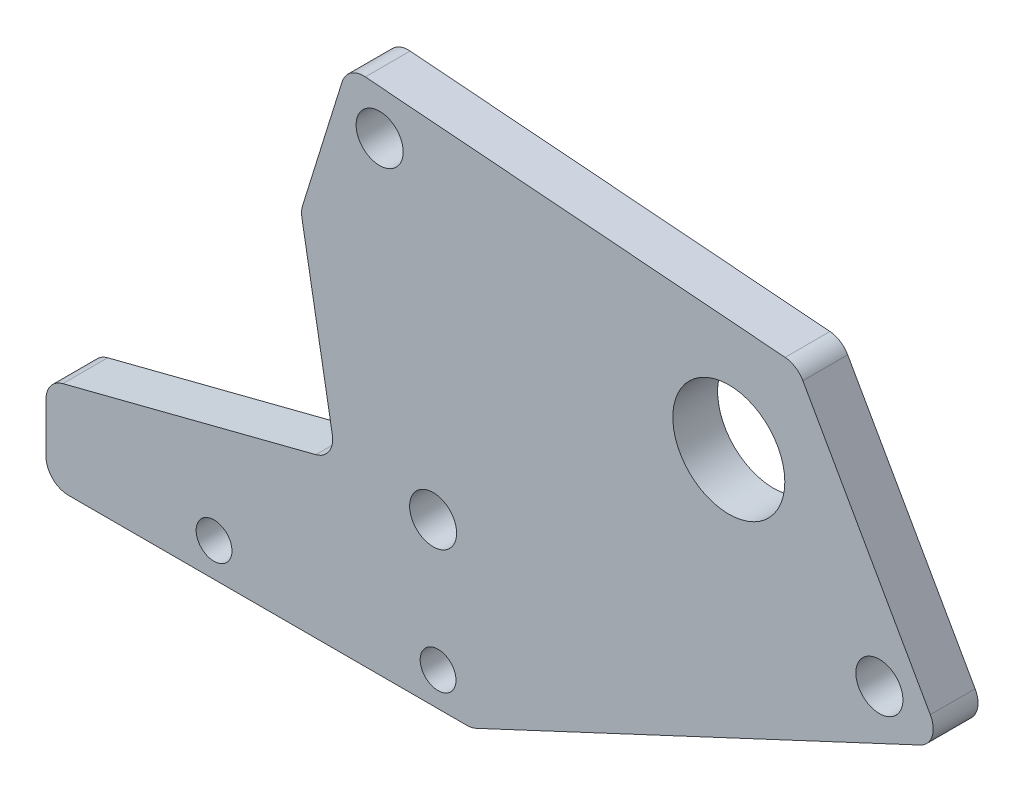
ISO-10303-21;
HEADER;
FILE_DESCRIPTION(('STEP AP214'),'2;1');
FILE_NAME('part.step','',(''),(''),'','','');
FILE_SCHEMA(('AUTOMOTIVE_DESIGN { 1 0 10303 214 1 1 1 1 }'));
ENDSEC;
DATA;
#1=APPLICATION_CONTEXT('core data for automotive mechanical design processes');
#2=APPLICATION_PROTOCOL_DEFINITION('international standard','automotive_design',2000,#1);
#3=PRODUCT_CONTEXT('',#1,'mechanical');
#4=PRODUCT('Part','Part','',(#3));
#5=PRODUCT_RELATED_PRODUCT_CATEGORY('part','',(#4));
#6=PRODUCT_DEFINITION_FORMATION('','',#4);
#7=PRODUCT_DEFINITION_CONTEXT('part definition',#1,'design');
#8=PRODUCT_DEFINITION('design','',#6,#7);
#9=PRODUCT_DEFINITION_SHAPE('','',#8);
#10=(LENGTH_UNIT() NAMED_UNIT(*) SI_UNIT(.MILLI.,.METRE.));
#11=(NAMED_UNIT(*) PLANE_ANGLE_UNIT() SI_UNIT($,.RADIAN.));
#12=(NAMED_UNIT(*) SI_UNIT($,.STERADIAN.) SOLID_ANGLE_UNIT());
#13=UNCERTAINTY_MEASURE_WITH_UNIT(LENGTH_MEASURE(1.E-05),#10,'distance_accuracy_value','');
#14=(GEOMETRIC_REPRESENTATION_CONTEXT(3) GLOBAL_UNCERTAINTY_ASSIGNED_CONTEXT((#13)) GLOBAL_UNIT_ASSIGNED_CONTEXT((#10,
#11,#12)) REPRESENTATION_CONTEXT('',''));
#15=CARTESIAN_POINT('',(0.,0.,0.));
#16=DIRECTION('',(0.,0.,1.));
#17=DIRECTION('',(1.,0.,0.));
#18=AXIS2_PLACEMENT_3D('',#15,#16,#17);
#19=CARTESIAN_POINT('',(0.,0.,4.));
#20=DIRECTION('',(0.,0.,1.));
#21=DIRECTION('',(1.,0.,0.));
#22=AXIS2_PLACEMENT_3D('',#19,#20,#21);
#23=PLANE('',#22);
#24=CARTESIAN_POINT('',(-3.,3.,4.));
#25=DIRECTION('',(0.,0.,1.));
#26=DIRECTION('',(1.,0.,0.));
#27=AXIS2_PLACEMENT_3D('',#24,#25,#26);
#28=CIRCLE('',#27,1.6);
#29=CARTESIAN_POINT('',(-1.4,3.,4.));
#30=VERTEX_POINT('',#29);
#31=EDGE_CURVE('E316',#30,#30,#28,.T.);
#32=ORIENTED_EDGE('',*,*,#31,.F.);
#33=EDGE_LOOP('',(#32));
#34=FACE_BOUND('',#33,.T.);
#35=CARTESIAN_POINT('',(36.3916982267954,21.4240687866271,4.));
#36=DIRECTION('',(0.,0.,1.));
#37=DIRECTION('',(1.,0.,0.));
#38=AXIS2_PLACEMENT_3D('',#35,#36,#37);
#39=CIRCLE('',#38,2.1);
#40=CARTESIAN_POINT('',(38.4916982267954,21.4240687866271,4.));
#41=VERTEX_POINT('',#40);
#42=EDGE_CURVE('E304',#41,#41,#39,.T.);
#43=ORIENTED_EDGE('',*,*,#42,.F.);
#44=EDGE_LOOP('',(#43));
#45=FACE_BOUND('',#44,.T.);
#46=CARTESIAN_POINT('',(-8.21910026838884,41.4822132078358,4.));
#47=DIRECTION('',(0.,0.,1.));
#48=DIRECTION('',(1.,0.,0.));
#49=AXIS2_PLACEMENT_3D('',#46,#47,#48);
#50=CIRCLE('',#49,2.1);
#51=CARTESIAN_POINT('',(-6.11910026838884,41.4822132078358,4.));
#52=VERTEX_POINT('',#51);
#53=EDGE_CURVE('E270',#52,#52,#50,.T.);
#54=ORIENTED_EDGE('',*,*,#53,.F.);
#55=EDGE_LOOP('',(#54));
#56=FACE_BOUND('',#55,.T.);
#57=DIRECTION('',(0.,-1.,0.));
#58=VECTOR('',#57,1.);
#59=CARTESIAN_POINT('',(-38.,0.,4.));
#60=LINE('',#59,#58);
#61=CARTESIAN_POINT('',(-38.,6.44876700839601,4.));
#62=VERTEX_POINT('',#61);
#63=CARTESIAN_POINT('',(-38.,2.,4.));
#64=VERTEX_POINT('',#63);
#65=EDGE_CURVE('E256',#62,#64,#60,.T.);
#66=ORIENTED_EDGE('',*,*,#65,.T.);
#67=CARTESIAN_POINT('',(-36.,2.,4.));
#68=DIRECTION('',(0.,0.,1.));
#69=DIRECTION('',(1.,0.,0.));
#70=AXIS2_PLACEMENT_3D('',#67,#68,#69);
#71=CIRCLE('',#70,2.);
#72=CARTESIAN_POINT('',(-36.,0.,4.));
#73=VERTEX_POINT('',#72);
#74=EDGE_CURVE('E209',#64,#73,#71,.T.);
#75=ORIENTED_EDGE('',*,*,#74,.T.);
#76=DIRECTION('',(1.,0.,0.));
#77=VECTOR('',#76,1.);
#78=CARTESIAN_POINT('',(0.,0.,4.));
#79=LINE('',#78,#77);
#80=CARTESIAN_POINT('',(-0.44431293165452,0.,4.));
#81=VERTEX_POINT('',#80);
#82=EDGE_CURVE('E166',#73,#81,#79,.T.);
#83=ORIENTED_EDGE('',*,*,#82,.T.);
#84=CARTESIAN_POINT('',(-0.44431293165452,2.,4.));
#85=DIRECTION('',(0.,0.,1.));
#86=DIRECTION('',(1.,0.,0.));
#87=AXIS2_PLACEMENT_3D('',#84,#85,#86);
#88=CIRCLE('',#87,2.);
#89=CARTESIAN_POINT('',(0.402518824547414,0.188129150108116,4.));
#90=VERTEX_POINT('',#89);
#91=EDGE_CURVE('E201',#81,#90,#88,.T.);
#92=ORIENTED_EDGE('',*,*,#91,.T.);
#93=DIRECTION('',(0.905935424945942,0.42341587810097,0.));
#94=VECTOR('',#93,1.);
#95=CARTESIAN_POINT('',(42.,19.629949763033,4.));
#96=LINE('',#95,#94);
#97=CARTESIAN_POINT('',(40.0426808695996,18.7151384249381,4.));
#98=VERTEX_POINT('',#97);
#99=EDGE_CURVE('E174',#90,#98,#96,.T.);
#100=ORIENTED_EDGE('',*,*,#99,.T.);
#101=CARTESIAN_POINT('',(39.1958491133977,20.52700927483,4.));
#102=DIRECTION('',(0.,0.,1.));
#103=DIRECTION('',(1.,0.,0.));
#104=AXIS2_PLACEMENT_3D('',#101,#102,#103);
#105=CIRCLE('',#104,2.);
#106=CARTESIAN_POINT('',(40.9370727479423,21.5109504593037,4.));
#107=VERTEX_POINT('',#106);
#108=EDGE_CURVE('E197',#98,#107,#105,.T.);
#109=ORIENTED_EDGE('',*,*,#108,.T.);
#110=DIRECTION('',(-0.491970592236835,0.870611817272278,0.));
#111=VECTOR('',#110,1.);
#112=CARTESIAN_POINT('',(29.0376611161664,42.5686489247927,4.));
#113=LINE('',#112,#111);
#114=CARTESIAN_POINT('',(29.5612662787403,41.6420552435545,4.));
#115=VERTEX_POINT('',#114);
#116=EDGE_CURVE('E178',#107,#115,#113,.T.);
#117=ORIENTED_EDGE('',*,*,#116,.T.);
#118=CARTESIAN_POINT('',(27.8200426441957,40.6581140590809,4.));
#119=DIRECTION('',(0.,0.,1.));
#120=DIRECTION('',(1.,0.,0.));
#121=AXIS2_PLACEMENT_3D('',#118,#119,#120);
#122=CIRCLE('',#121,2.);
#123=CARTESIAN_POINT('',(27.9766262550452,42.6519750303658,4.));
#124=VERTEX_POINT('',#123);
#125=EDGE_CURVE('E199',#115,#124,#122,.T.);
#126=ORIENTED_EDGE('',*,*,#125,.T.);
#127=DIRECTION('',(-0.996930485642473,0.0782918054247202,0.));
#128=VECTOR('',#127,1.);
#129=CARTESIAN_POINT('',(-11.0891315814272,45.7199208453955,4.));
#130=LINE('',#129,#128);
#131=CARTESIAN_POINT('',(-9.4975323140586,45.5949279979006,4.));
#132=VERTEX_POINT('',#131);
#133=EDGE_CURVE('E290',#124,#132,#130,.T.);
#134=ORIENTED_EDGE('',*,*,#133,.T.);
#135=CARTESIAN_POINT('',(-9.65411592490804,43.6010670266156,4.));
#136=DIRECTION('',(0.,0.,1.));
#137=DIRECTION('',(1.,0.,0.));
#138=AXIS2_PLACEMENT_3D('',#135,#136,#137);
#139=CIRCLE('',#138,2.);
#140=CARTESIAN_POINT('',(-11.5637085142052,44.1955888032576,4.));
#141=VERTEX_POINT('',#140);
#142=EDGE_CURVE('E205',#132,#141,#139,.T.);
#143=ORIENTED_EDGE('',*,*,#142,.T.);
#144=DIRECTION('',(-0.297260888320973,-0.954796294648563,0.));
#145=VECTOR('',#144,1.);
#146=CARTESIAN_POINT('',(-11.0891315814272,45.7199208453955,4.));
#147=LINE('',#146,#145);
#148=CARTESIAN_POINT('',(-15.0998511183774,32.8375663103456,4.));
#149=VERTEX_POINT('',#148);
#150=EDGE_CURVE('E261',#141,#149,#147,.T.);
#151=ORIENTED_EDGE('',*,*,#150,.T.);
#152=CARTESIAN_POINT('',(-13.1902585290803,32.2430445337037,4.));
#153=DIRECTION('',(0.,0.,1.));
#154=DIRECTION('',(1.,0.,0.));
#155=AXIS2_PLACEMENT_3D('',#152,#153,#154);
#156=CIRCLE('',#155,2.);
#157=CARTESIAN_POINT('',(-15.1598740351047,31.8957481783698,4.));
#158=VERTEX_POINT('',#157);
#159=EDGE_CURVE('E203',#149,#158,#156,.T.);
#160=ORIENTED_EDGE('',*,*,#159,.T.);
#161=DIRECTION('',(0.173648177666924,-0.984807753012209,0.));
#162=VECTOR('',#161,1.);
#163=CARTESIAN_POINT('',(-15.244192792074,32.3739436118223,4.));
#164=LINE('',#163,#162);
#165=CARTESIAN_POINT('',(-12.4401001650625,16.4711440757277,4.));
#166=VERTEX_POINT('',#165);
#167=EDGE_CURVE('E257',#158,#166,#164,.T.);
#168=ORIENTED_EDGE('',*,*,#167,.T.);
#169=CARTESIAN_POINT('',(-14.4097156710869,16.1238477203939,4.));
#170=DIRECTION('',(0.,0.,1.));
#171=DIRECTION('',(1.,0.,0.));
#172=AXIS2_PLACEMENT_3D('',#169,#170,#171);
#173=CIRCLE('',#172,2.);
#174=CARTESIAN_POINT('',(-13.9121834648029,14.1867205424032,4.));
#175=VERTEX_POINT('',#174);
#176=EDGE_CURVE('E11',#166,#175,#173,.F.);
#177=ORIENTED_EDGE('',*,*,#176,.T.);
#178=DIRECTION('',(-0.968563588995337,-0.248766103142034,0.));
#179=VECTOR('',#178,1.);
#180=CARTESIAN_POINT('',(-38.,8.,4.));
#181=LINE('',#180,#179);
#182=CARTESIAN_POINT('',(-36.4975322062841,8.38589418638668,4.));
#183=VERTEX_POINT('',#182);
#184=EDGE_CURVE('E254',#175,#183,#181,.T.);
#185=ORIENTED_EDGE('',*,*,#184,.T.);
#186=CARTESIAN_POINT('',(-36.,6.44876700839601,4.));
#187=DIRECTION('',(0.,0.,1.));
#188=DIRECTION('',(1.,0.,0.));
#189=AXIS2_PLACEMENT_3D('',#186,#187,#188);
#190=CIRCLE('',#189,2.);
#191=EDGE_CURVE('E207',#183,#62,#190,.T.);
#192=ORIENTED_EDGE('',*,*,#191,.T.);
#193=EDGE_LOOP('',(#66,#75,#83,#92,#100,#109,#117,#126,#134,#143,#151,#160,#168,#177,#185,#192));
#194=FACE_BOUND('',#193,.T.);
#195=CARTESIAN_POINT('',(-3.44377538254843,14.4,4.));
#196=DIRECTION('',(0.,0.,1.));
#197=DIRECTION('',(1.,0.,0.));
#198=AXIS2_PLACEMENT_3D('',#195,#196,#197);
#199=CIRCLE('',#198,2.1);
#200=CARTESIAN_POINT('',(-1.34377538254843,14.4,4.));
#201=VERTEX_POINT('',#200);
#202=EDGE_CURVE('E298',#201,#201,#199,.T.);
#203=ORIENTED_EDGE('',*,*,#202,.F.);
#204=EDGE_LOOP('',(#203));
#205=FACE_BOUND('',#204,.T.);
#206=CARTESIAN_POINT('',(22.9495687563132,33.0159745962337,4.));
#207=DIRECTION('',(0.,0.,1.));
#208=DIRECTION('',(1.,0.,0.));
#209=AXIS2_PLACEMENT_3D('',#206,#207,#208);
#210=CIRCLE('',#209,5.);
#211=CARTESIAN_POINT('',(27.9495687563132,33.0159745962337,4.));
#212=VERTEX_POINT('',#211);
#213=EDGE_CURVE('E310',#212,#212,#210,.T.);
#214=ORIENTED_EDGE('',*,*,#213,.F.);
#215=EDGE_LOOP('',(#214));
#216=FACE_BOUND('',#215,.T.);
#217=CARTESIAN_POINT('',(-23.,3.,4.));
#218=DIRECTION('',(0.,0.,1.));
#219=DIRECTION('',(1.,0.,0.));
#220=AXIS2_PLACEMENT_3D('',#217,#218,#219);
#221=CIRCLE('',#220,1.6);
#222=CARTESIAN_POINT('',(-21.4,3.,4.));
#223=VERTEX_POINT('',#222);
#224=EDGE_CURVE('E322',#223,#223,#221,.T.);
#225=ORIENTED_EDGE('',*,*,#224,.F.);
#226=EDGE_LOOP('',(#225));
#227=FACE_BOUND('',#226,.T.);
#228=ADVANCED_FACE('F33',(#34,#45,#56,#194,#205,#216,#227),#23,.T.);
#229=CARTESIAN_POINT('',(0.,0.,0.));
#230=DIRECTION('',(0.,0.,1.));
#231=DIRECTION('',(1.,0.,0.));
#232=AXIS2_PLACEMENT_3D('',#229,#230,#231);
#233=PLANE('',#232);
#234=DIRECTION('',(1.,0.,0.));
#235=VECTOR('',#234,1.);
#236=CARTESIAN_POINT('',(0.,0.,0.));
#237=LINE('',#236,#235);
#238=CARTESIAN_POINT('',(-36.,0.,0.));
#239=VERTEX_POINT('',#238);
#240=CARTESIAN_POINT('',(-0.44431293165452,0.,0.));
#241=VERTEX_POINT('',#240);
#242=EDGE_CURVE('E163',#239,#241,#237,.T.);
#243=ORIENTED_EDGE('',*,*,#242,.F.);
#244=CARTESIAN_POINT('',(-36.,2.,0.));
#245=DIRECTION('',(0.,0.,1.));
#246=DIRECTION('',(1.,0.,0.));
#247=AXIS2_PLACEMENT_3D('',#244,#245,#246);
#248=CIRCLE('',#247,2.);
#249=CARTESIAN_POINT('',(-38.,2.,0.));
#250=VERTEX_POINT('',#249);
#251=EDGE_CURVE('E146',#239,#250,#248,.F.);
#252=ORIENTED_EDGE('',*,*,#251,.T.);
#253=DIRECTION('',(0.,-1.,0.));
#254=VECTOR('',#253,1.);
#255=CARTESIAN_POINT('',(-38.,0.,0.));
#256=LINE('',#255,#254);
#257=CARTESIAN_POINT('',(-38.,6.44876700839601,0.));
#258=VERTEX_POINT('',#257);
#259=EDGE_CURVE('E175',#258,#250,#256,.T.);
#260=ORIENTED_EDGE('',*,*,#259,.F.);
#261=CARTESIAN_POINT('',(-36.,6.44876700839601,0.));
#262=DIRECTION('',(0.,0.,1.));
#263=DIRECTION('',(1.,0.,0.));
#264=AXIS2_PLACEMENT_3D('',#261,#262,#263);
#265=CIRCLE('',#264,2.);
#266=CARTESIAN_POINT('',(-36.4975322062841,8.38589418638668,0.));
#267=VERTEX_POINT('',#266);
#268=EDGE_CURVE('E157',#258,#267,#265,.F.);
#269=ORIENTED_EDGE('',*,*,#268,.T.);
#270=DIRECTION('',(-0.968563588995337,-0.248766103142034,0.));
#271=VECTOR('',#270,1.);
#272=CARTESIAN_POINT('',(-38.,8.,0.));
#273=LINE('',#272,#271);
#274=CARTESIAN_POINT('',(-13.9121834648029,14.1867205424032,0.));
#275=VERTEX_POINT('',#274);
#276=EDGE_CURVE('E180',#275,#267,#273,.T.);
#277=ORIENTED_EDGE('',*,*,#276,.F.);
#278=CARTESIAN_POINT('',(-14.4097156710869,16.1238477203939,0.));
#279=DIRECTION('',(0.,0.,1.));
#280=DIRECTION('',(1.,0.,0.));
#281=AXIS2_PLACEMENT_3D('',#278,#279,#280);
#282=CIRCLE('',#281,2.);
#283=CARTESIAN_POINT('',(-12.4401001650625,16.4711440757277,0.));
#284=VERTEX_POINT('',#283);
#285=EDGE_CURVE('E41',#275,#284,#282,.T.);
#286=ORIENTED_EDGE('',*,*,#285,.T.);
#287=DIRECTION('',(0.173648177666924,-0.984807753012209,0.));
#288=VECTOR('',#287,1.);
#289=CARTESIAN_POINT('',(-15.244192792074,32.3739436118223,0.));
#290=LINE('',#289,#288);
#291=CARTESIAN_POINT('',(-15.1598740351047,31.8957481783698,0.));
#292=VERTEX_POINT('',#291);
#293=EDGE_CURVE('E242',#292,#284,#290,.T.);
#294=ORIENTED_EDGE('',*,*,#293,.F.);
#295=CARTESIAN_POINT('',(-13.1902585290803,32.2430445337037,0.));
#296=DIRECTION('',(0.,0.,1.));
#297=DIRECTION('',(1.,0.,0.));
#298=AXIS2_PLACEMENT_3D('',#295,#296,#297);
#299=CIRCLE('',#298,2.);
#300=CARTESIAN_POINT('',(-15.0998511183774,32.8375663103456,0.));
#301=VERTEX_POINT('',#300);
#302=EDGE_CURVE('E189',#292,#301,#299,.F.);
#303=ORIENTED_EDGE('',*,*,#302,.T.);
#304=DIRECTION('',(-0.297260888320973,-0.954796294648563,0.));
#305=VECTOR('',#304,1.);
#306=CARTESIAN_POINT('',(-11.0891315814272,45.7199208453955,0.));
#307=LINE('',#306,#305);
#308=CARTESIAN_POINT('',(-11.5637085142052,44.1955888032576,0.));
#309=VERTEX_POINT('',#308);
#310=EDGE_CURVE('E250',#309,#301,#307,.T.);
#311=ORIENTED_EDGE('',*,*,#310,.F.);
#312=CARTESIAN_POINT('',(-9.65411592490804,43.6010670266156,0.));
#313=DIRECTION('',(0.,0.,1.));
#314=DIRECTION('',(1.,0.,0.));
#315=AXIS2_PLACEMENT_3D('',#312,#313,#314);
#316=CIRCLE('',#315,2.);
#317=CARTESIAN_POINT('',(-9.4975323140586,45.5949279979006,0.));
#318=VERTEX_POINT('',#317);
#319=EDGE_CURVE('E191',#309,#318,#316,.F.);
#320=ORIENTED_EDGE('',*,*,#319,.T.);
#321=DIRECTION('',(-0.996930485642473,0.0782918054247202,0.));
#322=VECTOR('',#321,1.);
#323=CARTESIAN_POINT('',(-11.0891315814272,45.7199208453955,0.));
#324=LINE('',#323,#322);
#325=CARTESIAN_POINT('',(27.9766262550452,42.6519750303658,0.));
#326=VERTEX_POINT('',#325);
#327=EDGE_CURVE('E273',#326,#318,#324,.T.);
#328=ORIENTED_EDGE('',*,*,#327,.F.);
#329=CARTESIAN_POINT('',(27.8200426441957,40.6581140590809,0.));
#330=DIRECTION('',(0.,0.,1.));
#331=DIRECTION('',(1.,0.,0.));
#332=AXIS2_PLACEMENT_3D('',#329,#330,#331);
#333=CIRCLE('',#332,2.);
#334=CARTESIAN_POINT('',(29.5612662787403,41.6420552435545,0.));
#335=VERTEX_POINT('',#334);
#336=EDGE_CURVE('E186',#326,#335,#333,.F.);
#337=ORIENTED_EDGE('',*,*,#336,.T.);
#338=DIRECTION('',(-0.491970592236835,0.870611817272278,0.));
#339=VECTOR('',#338,1.);
#340=CARTESIAN_POINT('',(29.0376611161664,42.5686489247927,0.));
#341=LINE('',#340,#339);
#342=CARTESIAN_POINT('',(40.9370727479423,21.5109504593037,0.));
#343=VERTEX_POINT('',#342);
#344=EDGE_CURVE('E269',#343,#335,#341,.T.);
#345=ORIENTED_EDGE('',*,*,#344,.F.);
#346=CARTESIAN_POINT('',(39.1958491133977,20.52700927483,0.));
#347=DIRECTION('',(0.,0.,1.));
#348=DIRECTION('',(1.,0.,0.));
#349=AXIS2_PLACEMENT_3D('',#346,#347,#348);
#350=CIRCLE('',#349,2.);
#351=CARTESIAN_POINT('',(40.0426808695996,18.7151384249381,0.));
#352=VERTEX_POINT('',#351);
#353=EDGE_CURVE('E167',#343,#352,#350,.F.);
#354=ORIENTED_EDGE('',*,*,#353,.T.);
#355=DIRECTION('',(0.905935424945942,0.42341587810097,0.));
#356=VECTOR('',#355,1.);
#357=CARTESIAN_POINT('',(42.,19.629949763033,0.));
#358=LINE('',#357,#356);
#359=CARTESIAN_POINT('',(0.402518824547414,0.188129150108116,0.));
#360=VERTEX_POINT('',#359);
#361=EDGE_CURVE('E266',#360,#352,#358,.T.);
#362=ORIENTED_EDGE('',*,*,#361,.F.);
#363=CARTESIAN_POINT('',(-0.44431293165452,2.,0.));
#364=DIRECTION('',(0.,0.,1.));
#365=DIRECTION('',(1.,0.,0.));
#366=AXIS2_PLACEMENT_3D('',#363,#364,#365);
#367=CIRCLE('',#366,2.);
#368=EDGE_CURVE('E173',#360,#241,#367,.F.);
#369=ORIENTED_EDGE('',*,*,#368,.T.);
#370=EDGE_LOOP('',(#243,#252,#260,#269,#277,#286,#294,#303,#311,#320,#328,#337,#345,#354,#362,#369));
#371=FACE_BOUND('',#370,.T.);
#372=CARTESIAN_POINT('',(-8.21910026838884,41.4822132078358,0.));
#373=DIRECTION('',(0.,0.,1.));
#374=DIRECTION('',(1.,0.,0.));
#375=AXIS2_PLACEMENT_3D('',#372,#373,#374);
#376=CIRCLE('',#375,2.1);
#377=CARTESIAN_POINT('',(-6.11910026838884,41.4822132078358,0.));
#378=VERTEX_POINT('',#377);
#379=EDGE_CURVE('E295',#378,#378,#376,.T.);
#380=ORIENTED_EDGE('',*,*,#379,.T.);
#381=EDGE_LOOP('',(#380));
#382=FACE_BOUND('',#381,.T.);
#383=CARTESIAN_POINT('',(-3.44377538254843,14.4,0.));
#384=DIRECTION('',(0.,0.,1.));
#385=DIRECTION('',(1.,0.,0.));
#386=AXIS2_PLACEMENT_3D('',#383,#384,#385);
#387=CIRCLE('',#386,2.1);
#388=CARTESIAN_POINT('',(-1.34377538254843,14.4,0.));
#389=VERTEX_POINT('',#388);
#390=EDGE_CURVE('E301',#389,#389,#387,.T.);
#391=ORIENTED_EDGE('',*,*,#390,.T.);
#392=EDGE_LOOP('',(#391));
#393=FACE_BOUND('',#392,.T.);
#394=CARTESIAN_POINT('',(36.3916982267954,21.4240687866271,0.));
#395=DIRECTION('',(0.,0.,1.));
#396=DIRECTION('',(1.,0.,0.));
#397=AXIS2_PLACEMENT_3D('',#394,#395,#396);
#398=CIRCLE('',#397,2.1);
#399=CARTESIAN_POINT('',(38.4916982267954,21.4240687866271,0.));
#400=VERTEX_POINT('',#399);
#401=EDGE_CURVE('E307',#400,#400,#398,.T.);
#402=ORIENTED_EDGE('',*,*,#401,.T.);
#403=EDGE_LOOP('',(#402));
#404=FACE_BOUND('',#403,.T.);
#405=CARTESIAN_POINT('',(22.9495687563132,33.0159745962337,0.));
#406=DIRECTION('',(0.,0.,1.));
#407=DIRECTION('',(1.,0.,0.));
#408=AXIS2_PLACEMENT_3D('',#405,#406,#407);
#409=CIRCLE('',#408,5.);
#410=CARTESIAN_POINT('',(27.9495687563132,33.0159745962337,0.));
#411=VERTEX_POINT('',#410);
#412=EDGE_CURVE('E313',#411,#411,#409,.T.);
#413=ORIENTED_EDGE('',*,*,#412,.T.);
#414=EDGE_LOOP('',(#413));
#415=FACE_BOUND('',#414,.T.);
#416=CARTESIAN_POINT('',(-3.,3.,0.));
#417=DIRECTION('',(0.,0.,1.));
#418=DIRECTION('',(1.,0.,0.));
#419=AXIS2_PLACEMENT_3D('',#416,#417,#418);
#420=CIRCLE('',#419,1.6);
#421=CARTESIAN_POINT('',(-1.4,3.,0.));
#422=VERTEX_POINT('',#421);
#423=EDGE_CURVE('E319',#422,#422,#420,.T.);
#424=ORIENTED_EDGE('',*,*,#423,.T.);
#425=EDGE_LOOP('',(#424));
#426=FACE_BOUND('',#425,.T.);
#427=CARTESIAN_POINT('',(-23.,3.,0.));
#428=DIRECTION('',(0.,0.,1.));
#429=DIRECTION('',(1.,0.,0.));
#430=AXIS2_PLACEMENT_3D('',#427,#428,#429);
#431=CIRCLE('',#430,1.6);
#432=CARTESIAN_POINT('',(-21.4,3.,0.));
#433=VERTEX_POINT('',#432);
#434=EDGE_CURVE('E325',#433,#433,#431,.T.);
#435=ORIENTED_EDGE('',*,*,#434,.T.);
#436=EDGE_LOOP('',(#435));
#437=FACE_BOUND('',#436,.T.);
#438=ADVANCED_FACE('F170',(#371,#382,#393,#404,#415,#426,#437),#233,.F.);
#439=CARTESIAN_POINT('',(42.,19.629949763033,4.));
#440=DIRECTION('',(-0.42341587810097,0.905935424945942,0.));
#441=DIRECTION('',(-0.905935424945942,-0.42341587810097,0.));
#442=AXIS2_PLACEMENT_3D('',#439,#440,#441);
#443=PLANE('',#442);
#444=ORIENTED_EDGE('',*,*,#99,.F.);
#445=DIRECTION('',(0.,0.,-1.));
#446=VECTOR('',#445,1.);
#447=CARTESIAN_POINT('',(0.402518824547414,0.188129150108116,4.));
#448=LINE('',#447,#446);
#449=EDGE_CURVE('E232',#90,#360,#448,.T.);
#450=ORIENTED_EDGE('',*,*,#449,.T.);
#451=ORIENTED_EDGE('',*,*,#361,.T.);
#452=DIRECTION('',(0.,0.,-1.));
#453=VECTOR('',#452,1.);
#454=CARTESIAN_POINT('',(40.0426808695996,18.7151384249381,4.));
#455=LINE('',#454,#453);
#456=EDGE_CURVE('E230',#352,#98,#455,.F.);
#457=ORIENTED_EDGE('',*,*,#456,.T.);
#458=EDGE_LOOP('',(#444,#450,#451,#457));
#459=FACE_BOUND('',#458,.T.);
#460=ADVANCED_FACE('F340',(#459),#443,.F.);
#461=CARTESIAN_POINT('',(29.0376611161664,42.5686489247927,4.));
#462=DIRECTION('',(-0.870611817272278,-0.491970592236835,0.));
#463=DIRECTION('',(0.491970592236835,-0.870611817272278,0.));
#464=AXIS2_PLACEMENT_3D('',#461,#462,#463);
#465=PLANE('',#464);
#466=ORIENTED_EDGE('',*,*,#344,.T.);
#467=DIRECTION('',(0.,0.,-1.));
#468=VECTOR('',#467,1.);
#469=CARTESIAN_POINT('',(29.5612662787403,41.6420552435545,4.));
#470=LINE('',#469,#468);
#471=EDGE_CURVE('E238',#335,#115,#470,.F.);
#472=ORIENTED_EDGE('',*,*,#471,.T.);
#473=ORIENTED_EDGE('',*,*,#116,.F.);
#474=DIRECTION('',(0.,0.,-1.));
#475=VECTOR('',#474,1.);
#476=CARTESIAN_POINT('',(40.9370727479423,21.5109504593037,4.));
#477=LINE('',#476,#475);
#478=EDGE_CURVE('E235',#107,#343,#477,.T.);
#479=ORIENTED_EDGE('',*,*,#478,.T.);
#480=EDGE_LOOP('',(#466,#472,#473,#479));
#481=FACE_BOUND('',#480,.T.);
#482=ADVANCED_FACE('F363',(#481),#465,.F.);
#483=CARTESIAN_POINT('',(-11.0891315814272,45.7199208453955,4.));
#484=DIRECTION('',(-0.0782918054247202,-0.996930485642473,0.));
#485=DIRECTION('',(0.996930485642474,-0.0782918054247202,0.));
#486=AXIS2_PLACEMENT_3D('',#483,#484,#485);
#487=PLANE('',#486);
#488=ORIENTED_EDGE('',*,*,#327,.T.);
#489=DIRECTION('',(0.,0.,-1.));
#490=VECTOR('',#489,1.);
#491=CARTESIAN_POINT('',(-9.4975323140586,45.5949279979006,4.));
#492=LINE('',#491,#490);
#493=EDGE_CURVE('E228',#318,#132,#492,.F.);
#494=ORIENTED_EDGE('',*,*,#493,.T.);
#495=ORIENTED_EDGE('',*,*,#133,.F.);
#496=DIRECTION('',(0.,0.,-1.));
#497=VECTOR('',#496,1.);
#498=CARTESIAN_POINT('',(27.9766262550452,42.6519750303658,4.));
#499=LINE('',#498,#497);
#500=EDGE_CURVE('E225',#124,#326,#499,.T.);
#501=ORIENTED_EDGE('',*,*,#500,.T.);
#502=EDGE_LOOP('',(#488,#494,#495,#501));
#503=FACE_BOUND('',#502,.T.);
#504=ADVANCED_FACE('F360',(#503),#487,.F.);
#505=CARTESIAN_POINT('',(-11.0891315814272,45.7199208453955,4.));
#506=DIRECTION('',(0.954796294648563,-0.297260888320973,0.));
#507=DIRECTION('',(0.297260888320973,0.954796294648563,0.));
#508=AXIS2_PLACEMENT_3D('',#505,#506,#507);
#509=PLANE('',#508);
#510=ORIENTED_EDGE('',*,*,#150,.F.);
#511=DIRECTION('',(0.,0.,-1.));
#512=VECTOR('',#511,1.);
#513=CARTESIAN_POINT('',(-11.5637085142052,44.1955888032576,4.));
#514=LINE('',#513,#512);
#515=EDGE_CURVE('E222',#141,#309,#514,.T.);
#516=ORIENTED_EDGE('',*,*,#515,.T.);
#517=ORIENTED_EDGE('',*,*,#310,.T.);
#518=DIRECTION('',(0.,0.,-1.));
#519=VECTOR('',#518,1.);
#520=CARTESIAN_POINT('',(-15.0998511183774,32.8375663103456,4.));
#521=LINE('',#520,#519);
#522=EDGE_CURVE('E220',#301,#149,#521,.F.);
#523=ORIENTED_EDGE('',*,*,#522,.T.);
#524=EDGE_LOOP('',(#510,#516,#517,#523));
#525=FACE_BOUND('',#524,.T.);
#526=ADVANCED_FACE('F281',(#525),#509,.F.);
#527=CARTESIAN_POINT('',(-15.244192792074,32.3739436118223,4.));
#528=DIRECTION('',(0.984807753012209,0.173648177666924,0.));
#529=DIRECTION('',(-0.173648177666924,0.984807753012209,0.));
#530=AXIS2_PLACEMENT_3D('',#527,#528,#529);
#531=PLANE('',#530);
#532=ORIENTED_EDGE('',*,*,#293,.T.);
#533=DIRECTION('',(0.,0.,-1.));
#534=VECTOR('',#533,1.);
#535=CARTESIAN_POINT('',(-12.4401001650625,16.4711440757277,4.));
#536=LINE('',#535,#534);
#537=EDGE_CURVE('E218',#284,#166,#536,.F.);
#538=ORIENTED_EDGE('',*,*,#537,.T.);
#539=ORIENTED_EDGE('',*,*,#167,.F.);
#540=DIRECTION('',(0.,0.,-1.));
#541=VECTOR('',#540,1.);
#542=CARTESIAN_POINT('',(-15.1598740351047,31.8957481783698,4.));
#543=LINE('',#542,#541);
#544=EDGE_CURVE('E215',#158,#292,#543,.T.);
#545=ORIENTED_EDGE('',*,*,#544,.T.);
#546=EDGE_LOOP('',(#532,#538,#539,#545));
#547=FACE_BOUND('',#546,.T.);
#548=ADVANCED_FACE('F247',(#547),#531,.F.);
#549=CARTESIAN_POINT('',(-38.,8.,4.));
#550=DIRECTION('',(0.248766103142034,-0.968563588995337,0.));
#551=DIRECTION('',(0.968563588995336,0.248766103142034,0.));
#552=AXIS2_PLACEMENT_3D('',#549,#550,#551);
#553=PLANE('',#552);
#554=ORIENTED_EDGE('',*,*,#276,.T.);
#555=DIRECTION('',(0.,0.,-1.));
#556=VECTOR('',#555,1.);
#557=CARTESIAN_POINT('',(-36.4975322062841,8.38589418638668,4.));
#558=LINE('',#557,#556);
#559=EDGE_CURVE('E48',#267,#183,#558,.F.);
#560=ORIENTED_EDGE('',*,*,#559,.T.);
#561=ORIENTED_EDGE('',*,*,#184,.F.);
#562=DIRECTION('',(0.,0.,-1.));
#563=VECTOR('',#562,1.);
#564=CARTESIAN_POINT('',(-13.9121834648029,14.1867205424032,0.));
#565=LINE('',#564,#563);
#566=EDGE_CURVE('E211',#175,#275,#565,.T.);
#567=ORIENTED_EDGE('',*,*,#566,.T.);
#568=EDGE_LOOP('',(#554,#560,#561,#567));
#569=FACE_BOUND('',#568,.T.);
#570=ADVANCED_FACE('F253',(#569),#553,.F.);
#571=CARTESIAN_POINT('',(-38.,0.,4.));
#572=DIRECTION('',(1.,0.,0.));
#573=DIRECTION('',(0.,0.,-1.));
#574=AXIS2_PLACEMENT_3D('',#571,#572,#573);
#575=PLANE('',#574);
#576=ORIENTED_EDGE('',*,*,#259,.T.);
#577=DIRECTION('',(0.,0.,-1.));
#578=VECTOR('',#577,1.);
#579=CARTESIAN_POINT('',(-38.,2.,4.));
#580=LINE('',#579,#578);
#581=EDGE_CURVE('E151',#250,#64,#580,.F.);
#582=ORIENTED_EDGE('',*,*,#581,.T.);
#583=ORIENTED_EDGE('',*,*,#65,.F.);
#584=DIRECTION('',(0.,0.,-1.));
#585=VECTOR('',#584,1.);
#586=CARTESIAN_POINT('',(-38.,6.44876700839601,4.));
#587=LINE('',#586,#585);
#588=EDGE_CURVE('E156',#62,#258,#587,.T.);
#589=ORIENTED_EDGE('',*,*,#588,.T.);
#590=EDGE_LOOP('',(#576,#582,#583,#589));
#591=FACE_BOUND('',#590,.T.);
#592=ADVANCED_FACE('F350',(#591),#575,.F.);
#593=CARTESIAN_POINT('',(0.,0.,4.));
#594=DIRECTION('',(0.,1.,0.));
#595=DIRECTION('',(0.,0.,1.));
#596=AXIS2_PLACEMENT_3D('',#593,#594,#595);
#597=PLANE('',#596);
#598=ORIENTED_EDGE('',*,*,#82,.F.);
#599=DIRECTION('',(0.,0.,-1.));
#600=VECTOR('',#599,1.);
#601=CARTESIAN_POINT('',(-36.,0.,4.));
#602=LINE('',#601,#600);
#603=EDGE_CURVE('E150',#73,#239,#602,.T.);
#604=ORIENTED_EDGE('',*,*,#603,.T.);
#605=ORIENTED_EDGE('',*,*,#242,.T.);
#606=DIRECTION('',(0.,0.,-1.));
#607=VECTOR('',#606,1.);
#608=CARTESIAN_POINT('',(-0.44431293165452,0.,4.));
#609=LINE('',#608,#607);
#610=EDGE_CURVE('E168',#241,#81,#609,.F.);
#611=ORIENTED_EDGE('',*,*,#610,.T.);
#612=EDGE_LOOP('',(#598,#604,#605,#611));
#613=FACE_BOUND('',#612,.T.);
#614=ADVANCED_FACE('F162',(#613),#597,.F.);
#615=CARTESIAN_POINT('',(-8.21910026838884,41.4822132078358,4.));
#616=DIRECTION('',(0.,0.,-1.));
#617=DIRECTION('',(-1.,0.,0.));
#618=AXIS2_PLACEMENT_3D('',#615,#616,#617);
#619=CYLINDRICAL_SURFACE('',#618,2.1);
#620=ORIENTED_EDGE('',*,*,#53,.T.);
#621=EDGE_LOOP('',(#620));
#622=FACE_BOUND('',#621,.T.);
#623=ORIENTED_EDGE('',*,*,#379,.F.);
#624=EDGE_LOOP('',(#623));
#625=FACE_BOUND('',#624,.T.);
#626=ADVANCED_FACE('F345',(#622,#625),#619,.F.);
#627=CARTESIAN_POINT('',(-3.44377538254843,14.4,4.));
#628=DIRECTION('',(0.,0.,-1.));
#629=DIRECTION('',(-1.,0.,0.));
#630=AXIS2_PLACEMENT_3D('',#627,#628,#629);
#631=CYLINDRICAL_SURFACE('',#630,2.1);
#632=ORIENTED_EDGE('',*,*,#202,.T.);
#633=EDGE_LOOP('',(#632));
#634=FACE_BOUND('',#633,.T.);
#635=ORIENTED_EDGE('',*,*,#390,.F.);
#636=EDGE_LOOP('',(#635));
#637=FACE_BOUND('',#636,.T.);
#638=ADVANCED_FACE('F551',(#634,#637),#631,.F.);
#639=CARTESIAN_POINT('',(36.3916982267954,21.4240687866271,4.));
#640=DIRECTION('',(0.,0.,-1.));
#641=DIRECTION('',(-1.,0.,0.));
#642=AXIS2_PLACEMENT_3D('',#639,#640,#641);
#643=CYLINDRICAL_SURFACE('',#642,2.1);
#644=ORIENTED_EDGE('',*,*,#42,.T.);
#645=EDGE_LOOP('',(#644));
#646=FACE_BOUND('',#645,.T.);
#647=ORIENTED_EDGE('',*,*,#401,.F.);
#648=EDGE_LOOP('',(#647));
#649=FACE_BOUND('',#648,.T.);
#650=ADVANCED_FACE('F541',(#646,#649),#643,.F.);
#651=CARTESIAN_POINT('',(22.9495687563132,33.0159745962337,4.));
#652=DIRECTION('',(0.,0.,-1.));
#653=DIRECTION('',(-1.,0.,0.));
#654=AXIS2_PLACEMENT_3D('',#651,#652,#653);
#655=CYLINDRICAL_SURFACE('',#654,5.);
#656=ORIENTED_EDGE('',*,*,#213,.T.);
#657=EDGE_LOOP('',(#656));
#658=FACE_BOUND('',#657,.T.);
#659=ORIENTED_EDGE('',*,*,#412,.F.);
#660=EDGE_LOOP('',(#659));
#661=FACE_BOUND('',#660,.T.);
#662=ADVANCED_FACE('F531',(#658,#661),#655,.F.);
#663=CARTESIAN_POINT('',(-3.,3.,4.));
#664=DIRECTION('',(0.,0.,-1.));
#665=DIRECTION('',(-1.,0.,0.));
#666=AXIS2_PLACEMENT_3D('',#663,#664,#665);
#667=CYLINDRICAL_SURFACE('',#666,1.6);
#668=ORIENTED_EDGE('',*,*,#31,.T.);
#669=EDGE_LOOP('',(#668));
#670=FACE_BOUND('',#669,.T.);
#671=ORIENTED_EDGE('',*,*,#423,.F.);
#672=EDGE_LOOP('',(#671));
#673=FACE_BOUND('',#672,.T.);
#674=ADVANCED_FACE('F522',(#670,#673),#667,.F.);
#675=CARTESIAN_POINT('',(-23.,3.,4.));
#676=DIRECTION('',(0.,0.,-1.));
#677=DIRECTION('',(-1.,0.,0.));
#678=AXIS2_PLACEMENT_3D('',#675,#676,#677);
#679=CYLINDRICAL_SURFACE('',#678,1.6);
#680=ORIENTED_EDGE('',*,*,#224,.T.);
#681=EDGE_LOOP('',(#680));
#682=FACE_BOUND('',#681,.T.);
#683=ORIENTED_EDGE('',*,*,#434,.F.);
#684=EDGE_LOOP('',(#683));
#685=FACE_BOUND('',#684,.T.);
#686=ADVANCED_FACE('F331',(#682,#685),#679,.F.);
#687=CARTESIAN_POINT('',(-36.,2.,4.));
#688=DIRECTION('',(0.,0.,-1.));
#689=DIRECTION('',(-1.,0.,0.));
#690=AXIS2_PLACEMENT_3D('',#687,#688,#689);
#691=CYLINDRICAL_SURFACE('',#690,2.);
#692=ORIENTED_EDGE('',*,*,#74,.F.);
#693=ORIENTED_EDGE('',*,*,#581,.F.);
#694=ORIENTED_EDGE('',*,*,#251,.F.);
#695=ORIENTED_EDGE('',*,*,#603,.F.);
#696=EDGE_LOOP('',(#692,#693,#694,#695));
#697=FACE_BOUND('',#696,.T.);
#698=ADVANCED_FACE('F149',(#697),#691,.T.);
#699=CARTESIAN_POINT('',(-36.,6.44876700839601,4.));
#700=DIRECTION('',(0.,0.,-1.));
#701=DIRECTION('',(-1.,0.,0.));
#702=AXIS2_PLACEMENT_3D('',#699,#700,#701);
#703=CYLINDRICAL_SURFACE('',#702,2.);
#704=ORIENTED_EDGE('',*,*,#191,.F.);
#705=ORIENTED_EDGE('',*,*,#559,.F.);
#706=ORIENTED_EDGE('',*,*,#268,.F.);
#707=ORIENTED_EDGE('',*,*,#588,.F.);
#708=EDGE_LOOP('',(#704,#705,#706,#707));
#709=FACE_BOUND('',#708,.T.);
#710=ADVANCED_FACE('F373',(#709),#703,.T.);
#711=CARTESIAN_POINT('',(-14.4097156710869,16.1238477203939,4.));
#712=DIRECTION('',(0.,0.,1.));
#713=DIRECTION('',(1.,0.,0.));
#714=AXIS2_PLACEMENT_3D('',#711,#712,#713);
#715=CYLINDRICAL_SURFACE('',#714,2.);
#716=ORIENTED_EDGE('',*,*,#176,.F.);
#717=ORIENTED_EDGE('',*,*,#537,.F.);
#718=ORIENTED_EDGE('',*,*,#285,.F.);
#719=ORIENTED_EDGE('',*,*,#566,.F.);
#720=EDGE_LOOP('',(#716,#717,#718,#719));
#721=FACE_BOUND('',#720,.T.);
#722=ADVANCED_FACE('F252',(#721),#715,.F.);
#723=CARTESIAN_POINT('',(-9.65411592490804,43.6010670266156,4.));
#724=DIRECTION('',(0.,0.,-1.));
#725=DIRECTION('',(-1.,0.,0.));
#726=AXIS2_PLACEMENT_3D('',#723,#724,#725);
#727=CYLINDRICAL_SURFACE('',#726,2.);
#728=ORIENTED_EDGE('',*,*,#142,.F.);
#729=ORIENTED_EDGE('',*,*,#493,.F.);
#730=ORIENTED_EDGE('',*,*,#319,.F.);
#731=ORIENTED_EDGE('',*,*,#515,.F.);
#732=EDGE_LOOP('',(#728,#729,#730,#731));
#733=FACE_BOUND('',#732,.T.);
#734=ADVANCED_FACE('F379',(#733),#727,.T.);
#735=CARTESIAN_POINT('',(-13.1902585290803,32.2430445337037,4.));
#736=DIRECTION('',(0.,0.,-1.));
#737=DIRECTION('',(-1.,0.,0.));
#738=AXIS2_PLACEMENT_3D('',#735,#736,#737);
#739=CYLINDRICAL_SURFACE('',#738,2.);
#740=ORIENTED_EDGE('',*,*,#159,.F.);
#741=ORIENTED_EDGE('',*,*,#522,.F.);
#742=ORIENTED_EDGE('',*,*,#302,.F.);
#743=ORIENTED_EDGE('',*,*,#544,.F.);
#744=EDGE_LOOP('',(#740,#741,#742,#743));
#745=FACE_BOUND('',#744,.T.);
#746=ADVANCED_FACE('F286',(#745),#739,.T.);
#747=CARTESIAN_POINT('',(-0.44431293165452,2.,4.));
#748=DIRECTION('',(0.,0.,-1.));
#749=DIRECTION('',(-1.,0.,0.));
#750=AXIS2_PLACEMENT_3D('',#747,#748,#749);
#751=CYLINDRICAL_SURFACE('',#750,2.);
#752=ORIENTED_EDGE('',*,*,#91,.F.);
#753=ORIENTED_EDGE('',*,*,#610,.F.);
#754=ORIENTED_EDGE('',*,*,#368,.F.);
#755=ORIENTED_EDGE('',*,*,#449,.F.);
#756=EDGE_LOOP('',(#752,#753,#754,#755));
#757=FACE_BOUND('',#756,.T.);
#758=ADVANCED_FACE('F385',(#757),#751,.T.);
#759=CARTESIAN_POINT('',(27.8200426441957,40.6581140590809,4.));
#760=DIRECTION('',(0.,0.,-1.));
#761=DIRECTION('',(-1.,0.,0.));
#762=AXIS2_PLACEMENT_3D('',#759,#760,#761);
#763=CYLINDRICAL_SURFACE('',#762,2.);
#764=ORIENTED_EDGE('',*,*,#125,.F.);
#765=ORIENTED_EDGE('',*,*,#471,.F.);
#766=ORIENTED_EDGE('',*,*,#336,.F.);
#767=ORIENTED_EDGE('',*,*,#500,.F.);
#768=EDGE_LOOP('',(#764,#765,#766,#767));
#769=FACE_BOUND('',#768,.T.);
#770=ADVANCED_FACE('F387',(#769),#763,.T.);
#771=CARTESIAN_POINT('',(39.1958491133977,20.52700927483,4.));
#772=DIRECTION('',(0.,0.,-1.));
#773=DIRECTION('',(-1.,0.,0.));
#774=AXIS2_PLACEMENT_3D('',#771,#772,#773);
#775=CYLINDRICAL_SURFACE('',#774,2.);
#776=ORIENTED_EDGE('',*,*,#108,.F.);
#777=ORIENTED_EDGE('',*,*,#456,.F.);
#778=ORIENTED_EDGE('',*,*,#353,.F.);
#779=ORIENTED_EDGE('',*,*,#478,.F.);
#780=EDGE_LOOP('',(#776,#777,#778,#779));
#781=FACE_BOUND('',#780,.T.);
#782=ADVANCED_FACE('F35',(#781),#775,.T.);
#783=CLOSED_SHELL('',(#228,#438,#460,#482,#504,#526,#548,#570,#592,#614,#626,#638,#650,#662,
#674,#686,#698,#710,#722,#734,#746,#758,#770,#782));
#784=MANIFOLD_SOLID_BREP('B2',#783);
#785=ADVANCED_BREP_SHAPE_REPRESENTATION('',(#18,#784),#14);
#786=SHAPE_DEFINITION_REPRESENTATION(#9,#785);
ENDSEC;
END-ISO-10303-21;
